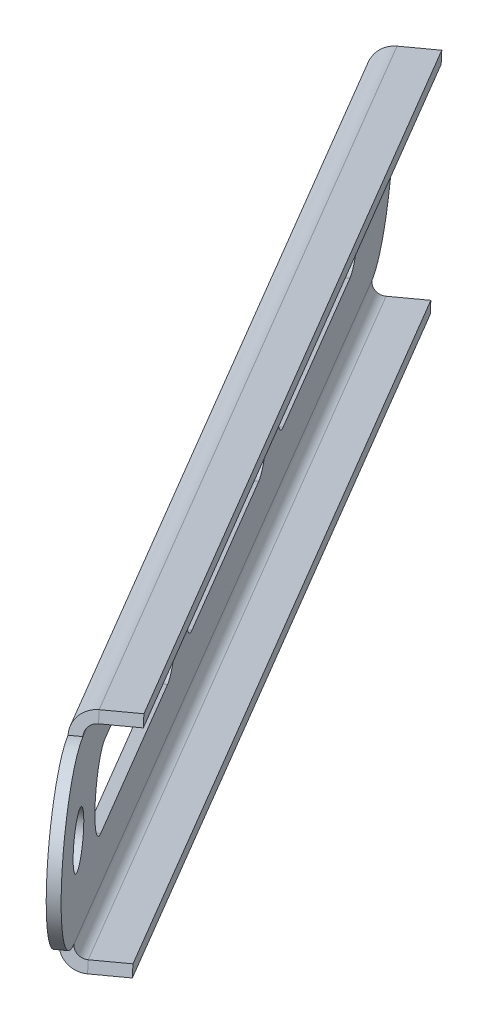
ISO-10303-21;
HEADER;
FILE_DESCRIPTION(('STEP AP214'),'2;1');
FILE_NAME('part.step','',(''),(''),'','','');
FILE_SCHEMA(('AUTOMOTIVE_DESIGN { 1 0 10303 214 1 1 1 1 }'));
ENDSEC;
DATA;
#1=APPLICATION_CONTEXT('core data for automotive mechanical design processes');
#2=APPLICATION_PROTOCOL_DEFINITION('international standard','automotive_design',2000,#1);
#3=PRODUCT_CONTEXT('',#1,'mechanical');
#4=PRODUCT('Part','Part','',(#3));
#5=PRODUCT_RELATED_PRODUCT_CATEGORY('part','',(#4));
#6=PRODUCT_DEFINITION_FORMATION('','',#4);
#7=PRODUCT_DEFINITION_CONTEXT('part definition',#1,'design');
#8=PRODUCT_DEFINITION('design','',#6,#7);
#9=PRODUCT_DEFINITION_SHAPE('','',#8);
#10=(LENGTH_UNIT() NAMED_UNIT(*) SI_UNIT(.MILLI.,.METRE.));
#11=(NAMED_UNIT(*) PLANE_ANGLE_UNIT() SI_UNIT($,.RADIAN.));
#12=(NAMED_UNIT(*) SI_UNIT($,.STERADIAN.) SOLID_ANGLE_UNIT());
#13=UNCERTAINTY_MEASURE_WITH_UNIT(LENGTH_MEASURE(1.E-05),#10,'distance_accuracy_value','');
#14=(GEOMETRIC_REPRESENTATION_CONTEXT(3) GLOBAL_UNCERTAINTY_ASSIGNED_CONTEXT((#13)) GLOBAL_UNIT_ASSIGNED_CONTEXT((#10,
#11,#12)) REPRESENTATION_CONTEXT('',''));
#15=CARTESIAN_POINT('',(0.,0.,0.));
#16=DIRECTION('',(0.,0.,1.));
#17=DIRECTION('',(1.,0.,0.));
#18=AXIS2_PLACEMENT_3D('',#15,#16,#17);
#19=CARTESIAN_POINT('',(45.9160006224801,2.19416637471988,-185.431775274375));
#20=DIRECTION('',(0.809016994374949,0.,-0.587785252292471));
#21=DIRECTION('',(-0.587785252292471,0.,-0.809016994374949));
#22=AXIS2_PLACEMENT_3D('',#19,#20,#21);
#23=CYLINDRICAL_SURFACE('',#22,5.);
#24=DIRECTION('',(0.809016994374949,0.,-0.587785252292471));
#25=VECTOR('',#24,1.);
#26=CARTESIAN_POINT('',(45.1456040160047,7.01932189784863,-186.49213523512));
#27=LINE('',#26,#25);
#28=CARTESIAN_POINT('',(43.9320785244423,7.01932189784863,-185.610457356681));
#29=VERTEX_POINT('',#28);
#30=CARTESIAN_POINT('',(45.1456040160047,7.01932189784863,-186.49213523512));
#31=VERTEX_POINT('',#30);
#32=EDGE_CURVE('E11',#29,#31,#27,.T.);
#33=ORIENTED_EDGE('',*,*,#32,.F.);
#34=CARTESIAN_POINT('',(44.7024751309177,2.19416637471988,-184.550097395936));
#35=DIRECTION('',(0.809016994374949,0.,-0.587785252292471));
#36=DIRECTION('',(-0.587785252292471,0.,-0.809016994374949));
#37=AXIS2_PLACEMENT_3D('',#34,#35,#36);
#38=CIRCLE('',#37,5.);
#39=CARTESIAN_POINT('',(45.4728717373931,-2.63098914840886,-183.489737435191));
#40=VERTEX_POINT('',#39);
#41=EDGE_CURVE('E122',#40,#29,#38,.T.);
#42=ORIENTED_EDGE('',*,*,#41,.F.);
#43=DIRECTION('',(0.809016994374949,0.,-0.587785252292471));
#44=VECTOR('',#43,1.);
#45=CARTESIAN_POINT('',(46.6863972289555,-2.63098914840886,-184.371415313629));
#46=LINE('',#45,#44);
#47=CARTESIAN_POINT('',(46.6863972289555,-2.63098914840886,-184.371415313629));
#48=VERTEX_POINT('',#47);
#49=EDGE_CURVE('E46',#40,#48,#46,.T.);
#50=ORIENTED_EDGE('',*,*,#49,.T.);
#51=CARTESIAN_POINT('',(45.9160006224801,2.19416637471988,-185.431775274375));
#52=DIRECTION('',(0.809016994374949,0.,-0.587785252292471));
#53=DIRECTION('',(-0.587785252292471,0.,-0.809016994374949));
#54=AXIS2_PLACEMENT_3D('',#51,#52,#53);
#55=CIRCLE('',#54,5.);
#56=EDGE_CURVE('E176',#48,#31,#55,.T.);
#57=ORIENTED_EDGE('',*,*,#56,.T.);
#58=EDGE_LOOP('',(#33,#42,#50,#57));
#59=FACE_BOUND('',#58,.T.);
#60=ADVANCED_FACE('F36',(#59),#23,.F.);
#61=CARTESIAN_POINT('',(71.6443196233266,8.90285568529785,-150.019782157494));
#62=DIRECTION('',(-0.154079321295082,0.965031104625748,-0.212071992149022));
#63=DIRECTION('',(-0.567231051302528,-0.262135398419992,-0.78072656374266));
#64=AXIS2_PLACEMENT_3D('',#61,#62,#63);
#65=PLANE('',#64);
#66=ORIENTED_EDGE('',*,*,#49,.F.);
#67=DIRECTION('',(-0.567231051302528,-0.262135398419992,-0.78072656374266));
#68=VECTOR('',#67,1.);
#69=CARTESIAN_POINT('',(70.4307941317641,8.90285568529785,-149.138104279056));
#70=LINE('',#69,#68);
#71=CARTESIAN_POINT('',(70.4307941317641,8.90285568529785,-149.138104279056));
#72=VERTEX_POINT('',#71);
#73=EDGE_CURVE('E134',#72,#40,#70,.T.);
#74=ORIENTED_EDGE('',*,*,#73,.F.);
#75=DIRECTION('',(0.809016994374949,0.,-0.587785252292471));
#76=VECTOR('',#75,1.);
#77=CARTESIAN_POINT('',(71.6443196233266,8.90285568529785,-150.019782157494));
#78=LINE('',#77,#76);
#79=CARTESIAN_POINT('',(71.6443196233266,8.90285568529785,-150.019782157494));
#80=VERTEX_POINT('',#79);
#81=EDGE_CURVE('E54',#72,#80,#78,.T.);
#82=ORIENTED_EDGE('',*,*,#81,.T.);
#83=DIRECTION('',(-0.567231051302528,-0.262135398419992,-0.78072656374266));
#84=VECTOR('',#83,1.);
#85=CARTESIAN_POINT('',(71.6443196233266,8.90285568529785,-150.019782157494));
#86=LINE('',#85,#84);
#87=EDGE_CURVE('E151',#80,#48,#86,.T.);
#88=ORIENTED_EDGE('',*,*,#87,.T.);
#89=EDGE_LOOP('',(#66,#74,#82,#88));
#90=FACE_BOUND('',#89,.T.);
#91=ADVANCED_FACE('F181',(#90),#65,.T.);
#92=CARTESIAN_POINT('',(70.8739230168511,13.7280112084266,-151.08014211824));
#93=DIRECTION('',(0.809016994374949,0.,-0.587785252292471));
#94=DIRECTION('',(-0.587785252292471,0.,-0.809016994374949));
#95=AXIS2_PLACEMENT_3D('',#92,#93,#94);
#96=CYLINDRICAL_SURFACE('',#95,5.);
#97=ORIENTED_EDGE('',*,*,#81,.F.);
#98=CARTESIAN_POINT('',(69.6603975252887,13.7280112084266,-150.198464239801));
#99=DIRECTION('',(0.809016994374949,0.,-0.587785252292471));
#100=DIRECTION('',(-0.587785252292471,0.,-0.809016994374949));
#101=AXIS2_PLACEMENT_3D('',#98,#99,#100);
#102=CIRCLE('',#101,5.);
#103=CARTESIAN_POINT('',(68.8900009188133,18.5531667315553,-151.258824200546));
#104=VERTEX_POINT('',#103);
#105=EDGE_CURVE('E121',#104,#72,#102,.T.);
#106=ORIENTED_EDGE('',*,*,#105,.F.);
#107=DIRECTION('',(0.809016994374949,0.,-0.587785252292471));
#108=VECTOR('',#107,1.);
#109=CARTESIAN_POINT('',(70.1035264103757,18.5531667315553,-152.140502078985));
#110=LINE('',#109,#108);
#111=CARTESIAN_POINT('',(70.1035264103757,18.5531667315553,-152.140502078985));
#112=VERTEX_POINT('',#111);
#113=EDGE_CURVE('E40',#104,#112,#110,.T.);
#114=ORIENTED_EDGE('',*,*,#113,.T.);
#115=CARTESIAN_POINT('',(70.8739230168511,13.7280112084266,-151.08014211824));
#116=DIRECTION('',(0.809016994374949,0.,-0.587785252292471));
#117=DIRECTION('',(-0.587785252292471,0.,-0.809016994374949));
#118=AXIS2_PLACEMENT_3D('',#115,#116,#117);
#119=CIRCLE('',#118,5.);
#120=EDGE_CURVE('E447',#112,#80,#119,.T.);
#121=ORIENTED_EDGE('',*,*,#120,.T.);
#122=EDGE_LOOP('',(#97,#106,#114,#121));
#123=FACE_BOUND('',#122,.T.);
#124=ADVANCED_FACE('F124',(#123),#96,.F.);
#125=CARTESIAN_POINT('',(113.983239052903,33.650188791573,-91.7452589223394));
#126=DIRECTION('',(0.809016994374949,0.,-0.587785252292471));
#127=DIRECTION('',(-0.587785252292471,0.,-0.809016994374949));
#128=AXIS2_PLACEMENT_3D('',#125,#126,#127);
#129=CYLINDRICAL_SURFACE('',#128,5.00000000000001);
#130=DIRECTION('',(0.809016994374949,0.,-0.587785252292471));
#131=VECTOR('',#130,1.);
#132=CARTESIAN_POINT('',(113.212842446428,38.4753443147018,-92.8056188830845));
#133=LINE('',#132,#131);
#134=CARTESIAN_POINT('',(111.999316954865,38.4753443147018,-91.9239410046458));
#135=VERTEX_POINT('',#134);
#136=CARTESIAN_POINT('',(113.212842446428,38.4753443147018,-92.8056188830845));
#137=VERTEX_POINT('',#136);
#138=EDGE_CURVE('E116',#135,#137,#133,.T.);
#139=ORIENTED_EDGE('',*,*,#138,.F.);
#140=CARTESIAN_POINT('',(112.769713561341,33.650188791573,-90.8635810439007));
#141=DIRECTION('',(0.809016994374949,0.,-0.587785252292471));
#142=DIRECTION('',(-0.587785252292471,0.,-0.809016994374949));
#143=AXIS2_PLACEMENT_3D('',#140,#141,#142);
#144=CIRCLE('',#143,5.00000000000001);
#145=CARTESIAN_POINT('',(113.540110167816,28.8250332684443,-89.8032210831556));
#146=VERTEX_POINT('',#145);
#147=EDGE_CURVE('E128',#146,#135,#144,.T.);
#148=ORIENTED_EDGE('',*,*,#147,.F.);
#149=DIRECTION('',(0.809016994374949,0.,-0.587785252292471));
#150=VECTOR('',#149,1.);
#151=CARTESIAN_POINT('',(114.753635659378,28.8250332684443,-90.6848989615943));
#152=LINE('',#151,#150);
#153=CARTESIAN_POINT('',(114.753635659378,28.8250332684443,-90.6848989615943));
#154=VERTEX_POINT('',#153);
#155=EDGE_CURVE('E167',#146,#154,#152,.T.);
#156=ORIENTED_EDGE('',*,*,#155,.T.);
#157=CARTESIAN_POINT('',(113.983239052903,33.650188791573,-91.7452589223394));
#158=DIRECTION('',(0.809016994374949,0.,-0.587785252292471));
#159=DIRECTION('',(-0.587785252292471,0.,-0.809016994374949));
#160=AXIS2_PLACEMENT_3D('',#157,#158,#159);
#161=CIRCLE('',#160,5.00000000000001);
#162=EDGE_CURVE('E443',#154,#137,#161,.T.);
#163=ORIENTED_EDGE('',*,*,#162,.T.);
#164=EDGE_LOOP('',(#139,#148,#156,#163));
#165=FACE_BOUND('',#164,.T.);
#166=ADVANCED_FACE('F450',(#165),#129,.F.);
#167=CARTESIAN_POINT('',(139.711558053749,40.358878102151,-56.3332658054592));
#168=DIRECTION('',(-0.154079321295082,0.965031104625748,-0.212071992149022));
#169=DIRECTION('',(-0.567231051302528,-0.262135398419992,-0.78072656374266));
#170=AXIS2_PLACEMENT_3D('',#167,#168,#169);
#171=PLANE('',#170);
#172=ORIENTED_EDGE('',*,*,#155,.F.);
#173=DIRECTION('',(-0.567231051302528,-0.262135398419992,-0.78072656374266));
#174=VECTOR('',#173,1.);
#175=CARTESIAN_POINT('',(138.498032562187,40.358878102151,-55.4515879270205));
#176=LINE('',#175,#174);
#177=CARTESIAN_POINT('',(138.498032562187,40.358878102151,-55.4515879270205));
#178=VERTEX_POINT('',#177);
#179=EDGE_CURVE('E125',#178,#146,#176,.T.);
#180=ORIENTED_EDGE('',*,*,#179,.F.);
#181=DIRECTION('',(0.809016994374949,0.,-0.587785252292471));
#182=VECTOR('',#181,1.);
#183=CARTESIAN_POINT('',(139.711558053749,40.358878102151,-56.3332658054592));
#184=LINE('',#183,#182);
#185=CARTESIAN_POINT('',(139.711558053749,40.358878102151,-56.3332658054592));
#186=VERTEX_POINT('',#185);
#187=EDGE_CURVE('E164',#178,#186,#184,.T.);
#188=ORIENTED_EDGE('',*,*,#187,.T.);
#189=DIRECTION('',(-0.567231051302528,-0.262135398419992,-0.78072656374266));
#190=VECTOR('',#189,1.);
#191=CARTESIAN_POINT('',(139.711558053749,40.358878102151,-56.3332658054592));
#192=LINE('',#191,#190);
#193=EDGE_CURVE('E237',#186,#154,#192,.T.);
#194=ORIENTED_EDGE('',*,*,#193,.T.);
#195=EDGE_LOOP('',(#172,#180,#188,#194));
#196=FACE_BOUND('',#195,.T.);
#197=ADVANCED_FACE('F235',(#196),#171,.T.);
#198=CARTESIAN_POINT('',(138.941161447274,45.1840336252797,-57.3936257662043));
#199=DIRECTION('',(0.809016994374949,0.,-0.587785252292471));
#200=DIRECTION('',(-0.587785252292471,0.,-0.809016994374949));
#201=AXIS2_PLACEMENT_3D('',#198,#199,#200);
#202=CYLINDRICAL_SURFACE('',#201,5.00000000000001);
#203=ORIENTED_EDGE('',*,*,#187,.F.);
#204=CARTESIAN_POINT('',(137.727635955712,45.1840336252797,-56.5119478877656));
#205=DIRECTION('',(0.809016994374949,0.,-0.587785252292471));
#206=DIRECTION('',(-0.587785252292471,0.,-0.809016994374949));
#207=AXIS2_PLACEMENT_3D('',#204,#205,#206);
#208=CIRCLE('',#207,5.00000000000001);
#209=CARTESIAN_POINT('',(136.957239349236,50.0091891484085,-57.5723078485107));
#210=VERTEX_POINT('',#209);
#211=EDGE_CURVE('E215',#210,#178,#208,.T.);
#212=ORIENTED_EDGE('',*,*,#211,.F.);
#213=DIRECTION('',(0.809016994374949,0.,-0.587785252292471));
#214=VECTOR('',#213,1.);
#215=CARTESIAN_POINT('',(138.170764840799,50.0091891484085,-58.4539857269494));
#216=LINE('',#215,#214);
#217=CARTESIAN_POINT('',(138.170764840799,50.0091891484085,-58.4539857269494));
#218=VERTEX_POINT('',#217);
#219=EDGE_CURVE('E161',#210,#218,#216,.T.);
#220=ORIENTED_EDGE('',*,*,#219,.T.);
#221=CARTESIAN_POINT('',(138.941161447274,45.1840336252797,-57.3936257662043));
#222=DIRECTION('',(0.809016994374949,0.,-0.587785252292471));
#223=DIRECTION('',(-0.587785252292471,0.,-0.809016994374949));
#224=AXIS2_PLACEMENT_3D('',#221,#222,#223);
#225=CIRCLE('',#224,5.00000000000001);
#226=EDGE_CURVE('E231',#218,#186,#225,.T.);
#227=ORIENTED_EDGE('',*,*,#226,.T.);
#228=EDGE_LOOP('',(#203,#212,#220,#227));
#229=FACE_BOUND('',#228,.T.);
#230=ADVANCED_FACE('F226',(#229),#202,.F.);
#231=CARTESIAN_POINT('',(148.016858268115,49.3781999999996,-44.9020007463218));
#232=DIRECTION('',(0.809016994374949,0.,-0.587785252292471));
#233=DIRECTION('',(-0.587785252292471,0.,-0.809016994374949));
#234=AXIS2_PLACEMENT_3D('',#231,#232,#233);
#235=CYLINDRICAL_SURFACE('',#234,11.);
#236=DIRECTION('',(0.809016994374949,0.,-0.587785252292471));
#237=VECTOR('',#236,1.);
#238=CARTESIAN_POINT('',(146.321985733869,59.9935421508828,-47.234792659961));
#239=LINE('',#238,#237);
#240=CARTESIAN_POINT('',(145.108460242306,59.9935421508828,-46.3531147815223));
#241=VERTEX_POINT('',#240);
#242=CARTESIAN_POINT('',(146.321985733869,59.9935421508828,-47.234792659961));
#243=VERTEX_POINT('',#242);
#244=EDGE_CURVE('E158',#241,#243,#239,.T.);
#245=ORIENTED_EDGE('',*,*,#244,.F.);
#246=CARTESIAN_POINT('',(146.803332776552,49.3781999999996,-44.0203228678831));
#247=DIRECTION('',(0.809016994374949,0.,-0.587785252292471));
#248=DIRECTION('',(-0.587785252292471,0.,-0.809016994374949));
#249=AXIS2_PLACEMENT_3D('',#246,#247,#248);
#250=CIRCLE('',#249,11.);
#251=CARTESIAN_POINT('',(148.498205310798,38.7628578491164,-41.6875309542438));
#252=VERTEX_POINT('',#251);
#253=EDGE_CURVE('E209',#241,#252,#250,.T.);
#254=ORIENTED_EDGE('',*,*,#253,.T.);
#255=DIRECTION('',(0.809016994374949,0.,-0.587785252292471));
#256=VECTOR('',#255,1.);
#257=CARTESIAN_POINT('',(149.71173080236,38.7628578491164,-42.5692088326825));
#258=LINE('',#257,#256);
#259=CARTESIAN_POINT('',(149.71173080236,38.7628578491164,-42.5692088326825));
#260=VERTEX_POINT('',#259);
#261=EDGE_CURVE('E155',#252,#260,#258,.T.);
#262=ORIENTED_EDGE('',*,*,#261,.T.);
#263=CARTESIAN_POINT('',(148.016858268115,49.3781999999996,-44.9020007463218));
#264=DIRECTION('',(0.809016994374949,0.,-0.587785252292471));
#265=DIRECTION('',(-0.587785252292471,0.,-0.809016994374949));
#266=AXIS2_PLACEMENT_3D('',#263,#264,#265);
#267=CIRCLE('',#266,11.);
#268=EDGE_CURVE('E430',#243,#260,#267,.T.);
#269=ORIENTED_EDGE('',*,*,#268,.F.);
#270=EDGE_LOOP('',(#245,#254,#262,#269));
#271=FACE_BOUND('',#270,.T.);
#272=ADVANCED_FACE('F481',(#271),#235,.T.);
#273=CARTESIAN_POINT('',(36.8403038016397,-2.,-197.923400294257));
#274=DIRECTION('',(0.809016994374949,0.,-0.587785252292471));
#275=DIRECTION('',(-0.587785252292471,0.,-0.809016994374949));
#276=AXIS2_PLACEMENT_3D('',#273,#274,#275);
#277=CYLINDRICAL_SURFACE('',#276,11.);
#278=DIRECTION('',(0.809016994374949,0.,-0.587785252292471));
#279=VECTOR('',#278,1.);
#280=CARTESIAN_POINT('',(38.5351763358856,-12.6153421508832,-195.590608380618));
#281=LINE('',#280,#279);
#282=CARTESIAN_POINT('',(37.3216508443235,-12.6153421508833,-194.708930502179));
#283=VERTEX_POINT('',#282);
#284=CARTESIAN_POINT('',(38.5351763358856,-12.6153421508832,-195.590608380618));
#285=VERTEX_POINT('',#284);
#286=EDGE_CURVE('E152',#283,#285,#281,.T.);
#287=ORIENTED_EDGE('',*,*,#286,.F.);
#288=CARTESIAN_POINT('',(35.6267783100773,-2.,-197.041722415818));
#289=DIRECTION('',(0.809016994374949,0.,-0.587785252292471));
#290=DIRECTION('',(-0.587785252292471,0.,-0.809016994374949));
#291=AXIS2_PLACEMENT_3D('',#288,#289,#290);
#292=CIRCLE('',#291,11.);
#293=CARTESIAN_POINT('',(33.9319057758313,8.61534215088324,-199.374514329458));
#294=VERTEX_POINT('',#293);
#295=EDGE_CURVE('E201',#283,#294,#292,.T.);
#296=ORIENTED_EDGE('',*,*,#295,.T.);
#297=DIRECTION('',(0.809016994374949,0.,-0.587785252292471));
#298=VECTOR('',#297,1.);
#299=CARTESIAN_POINT('',(35.1454312673938,8.61534215088323,-200.256192207896));
#300=LINE('',#299,#298);
#301=CARTESIAN_POINT('',(35.1454312673938,8.61534215088323,-200.256192207896));
#302=VERTEX_POINT('',#301);
#303=EDGE_CURVE('E148',#294,#302,#300,.T.);
#304=ORIENTED_EDGE('',*,*,#303,.T.);
#305=CARTESIAN_POINT('',(36.8403038016397,-2.,-197.923400294257));
#306=DIRECTION('',(0.809016994374949,0.,-0.587785252292471));
#307=DIRECTION('',(0.587785252292471,0.,0.809016994374949));
#308=AXIS2_PLACEMENT_3D('',#305,#306,#307);
#309=CIRCLE('',#308,11.);
#310=EDGE_CURVE('E425',#285,#302,#309,.T.);
#311=ORIENTED_EDGE('',*,*,#310,.F.);
#312=EDGE_LOOP('',(#287,#296,#304,#311));
#313=FACE_BOUND('',#312,.T.);
#314=ADVANCED_FACE('F485',(#313),#277,.T.);
#315=CARTESIAN_POINT('',(79.9496198376916,17.9221775831464,-138.588517098357));
#316=DIRECTION('',(0.809016994374949,0.,-0.587785252292471));
#317=DIRECTION('',(-0.587785252292471,0.,-0.809016994374949));
#318=AXIS2_PLACEMENT_3D('',#315,#316,#317);
#319=CYLINDRICAL_SURFACE('',#318,5.00000000000002);
#320=DIRECTION('',(0.809016994374949,0.,-0.587785252292471));
#321=VECTOR('',#320,1.);
#322=CARTESIAN_POINT('',(79.1792232312162,22.7473331062752,-139.648877059102));
#323=LINE('',#322,#321);
#324=CARTESIAN_POINT('',(77.9656977396537,22.7473331062752,-138.767199180663));
#325=VERTEX_POINT('',#324);
#326=CARTESIAN_POINT('',(79.1792232312162,22.7473331062752,-139.648877059102));
#327=VERTEX_POINT('',#326);
#328=EDGE_CURVE('E145',#325,#327,#323,.T.);
#329=ORIENTED_EDGE('',*,*,#328,.F.);
#330=CARTESIAN_POINT('',(78.7360943461292,17.9221775831464,-137.706839219918));
#331=DIRECTION('',(0.809016994374949,0.,-0.587785252292471));
#332=DIRECTION('',(-0.587785252292471,0.,-0.809016994374949));
#333=AXIS2_PLACEMENT_3D('',#330,#331,#332);
#334=CIRCLE('',#333,5.00000000000002);
#335=CARTESIAN_POINT('',(79.5064909526046,13.0970220600177,-136.646479259173));
#336=VERTEX_POINT('',#335);
#337=EDGE_CURVE('E194',#336,#325,#334,.T.);
#338=ORIENTED_EDGE('',*,*,#337,.F.);
#339=DIRECTION('',(0.809016994374949,0.,-0.587785252292471));
#340=VECTOR('',#339,1.);
#341=CARTESIAN_POINT('',(80.720016444167,13.0970220600177,-137.528157137612));
#342=LINE('',#341,#340);
#343=CARTESIAN_POINT('',(80.720016444167,13.0970220600177,-137.528157137612));
#344=VERTEX_POINT('',#343);
#345=EDGE_CURVE('E141',#336,#344,#342,.T.);
#346=ORIENTED_EDGE('',*,*,#345,.T.);
#347=CARTESIAN_POINT('',(79.9496198376916,17.9221775831464,-138.588517098357));
#348=DIRECTION('',(0.809016994374949,0.,-0.587785252292471));
#349=DIRECTION('',(-0.587785252292471,0.,-0.809016994374949));
#350=AXIS2_PLACEMENT_3D('',#347,#348,#349);
#351=CIRCLE('',#350,5.00000000000002);
#352=EDGE_CURVE('E416',#344,#327,#351,.T.);
#353=ORIENTED_EDGE('',*,*,#352,.T.);
#354=EDGE_LOOP('',(#329,#338,#346,#353));
#355=FACE_BOUND('',#354,.T.);
#356=ADVANCED_FACE('F489',(#355),#319,.F.);
#357=CARTESIAN_POINT('',(105.677938838538,24.6308668937244,-103.176523981477));
#358=DIRECTION('',(-0.154079321295082,0.965031104625748,-0.212071992149022));
#359=DIRECTION('',(-0.567231051302528,-0.262135398419992,-0.780726563742659));
#360=AXIS2_PLACEMENT_3D('',#357,#358,#359);
#361=PLANE('',#360);
#362=ORIENTED_EDGE('',*,*,#345,.F.);
#363=DIRECTION('',(-0.567231051302528,-0.262135398419992,-0.780726563742659));
#364=VECTOR('',#363,1.);
#365=CARTESIAN_POINT('',(104.464413346976,24.6308668937244,-102.294846103038));
#366=LINE('',#365,#364);
#367=CARTESIAN_POINT('',(104.464413346976,24.6308668937244,-102.294846103038));
#368=VERTEX_POINT('',#367);
#369=EDGE_CURVE('E190',#368,#336,#366,.T.);
#370=ORIENTED_EDGE('',*,*,#369,.F.);
#371=DIRECTION('',(0.809016994374949,0.,-0.587785252292471));
#372=VECTOR('',#371,1.);
#373=CARTESIAN_POINT('',(105.677938838538,24.6308668937244,-103.176523981477));
#374=LINE('',#373,#372);
#375=CARTESIAN_POINT('',(105.677938838538,24.6308668937244,-103.176523981477));
#376=VERTEX_POINT('',#375);
#377=EDGE_CURVE('E138',#368,#376,#374,.T.);
#378=ORIENTED_EDGE('',*,*,#377,.T.);
#379=DIRECTION('',(-0.567231051302528,-0.262135398419992,-0.780726563742659));
#380=VECTOR('',#379,1.);
#381=CARTESIAN_POINT('',(105.677938838538,24.6308668937244,-103.176523981477));
#382=LINE('',#381,#380);
#383=EDGE_CURVE('E419',#376,#344,#382,.T.);
#384=ORIENTED_EDGE('',*,*,#383,.T.);
#385=EDGE_LOOP('',(#362,#370,#378,#384));
#386=FACE_BOUND('',#385,.T.);
#387=ADVANCED_FACE('F501',(#386),#361,.T.);
#388=CARTESIAN_POINT('',(104.907542232063,29.4560224168532,-104.236883942222));
#389=DIRECTION('',(0.809016994374949,0.,-0.587785252292471));
#390=DIRECTION('',(-0.587785252292471,0.,-0.809016994374949));
#391=AXIS2_PLACEMENT_3D('',#388,#389,#390);
#392=CYLINDRICAL_SURFACE('',#391,5.00000000000001);
#393=ORIENTED_EDGE('',*,*,#377,.F.);
#394=CARTESIAN_POINT('',(103.6940167405,29.4560224168532,-103.355206063783));
#395=DIRECTION('',(0.809016994374949,0.,-0.587785252292471));
#396=DIRECTION('',(-0.587785252292471,0.,-0.809016994374949));
#397=AXIS2_PLACEMENT_3D('',#394,#395,#396);
#398=CIRCLE('',#397,5.00000000000001);
#399=CARTESIAN_POINT('',(102.923620134025,34.2811779399819,-104.415566024528));
#400=VERTEX_POINT('',#399);
#401=EDGE_CURVE('E185',#400,#368,#398,.T.);
#402=ORIENTED_EDGE('',*,*,#401,.F.);
#403=DIRECTION('',(0.809016994374949,0.,-0.587785252292471));
#404=VECTOR('',#403,1.);
#405=CARTESIAN_POINT('',(104.137145625587,34.2811779399819,-105.297243902967));
#406=LINE('',#405,#404);
#407=CARTESIAN_POINT('',(104.137145625587,34.2811779399819,-105.297243902967));
#408=VERTEX_POINT('',#407);
#409=EDGE_CURVE('E142',#400,#408,#406,.T.);
#410=ORIENTED_EDGE('',*,*,#409,.T.);
#411=CARTESIAN_POINT('',(104.907542232063,29.4560224168532,-104.236883942222));
#412=DIRECTION('',(0.809016994374949,0.,-0.587785252292471));
#413=DIRECTION('',(-0.587785252292471,0.,-0.809016994374949));
#414=AXIS2_PLACEMENT_3D('',#411,#412,#413);
#415=CIRCLE('',#414,5.00000000000001);
#416=EDGE_CURVE('E136',#408,#376,#415,.T.);
#417=ORIENTED_EDGE('',*,*,#416,.T.);
#418=EDGE_LOOP('',(#393,#402,#410,#417));
#419=FACE_BOUND('',#418,.T.);
#420=ADVANCED_FACE('F497',(#419),#392,.F.);
#421=CARTESIAN_POINT('',(104.137145625587,34.2811779399819,-105.297243902967));
#422=DIRECTION('',(0.154079321295082,-0.965031104625748,0.212071992149021));
#423=DIRECTION('',(0.567231051302528,0.262135398419992,0.78072656374266));
#424=AXIS2_PLACEMENT_3D('',#421,#422,#423);
#425=PLANE('',#424);
#426=DIRECTION('',(0.567231051302528,0.262135398419992,0.78072656374266));
#427=VECTOR('',#426,1.);
#428=CARTESIAN_POINT('',(102.923620134025,34.2811779399819,-104.415566024528));
#429=LINE('',#428,#427);
#430=EDGE_CURVE('E188',#325,#400,#429,.T.);
#431=ORIENTED_EDGE('',*,*,#430,.F.);
#432=ORIENTED_EDGE('',*,*,#328,.T.);
#433=DIRECTION('',(0.567231051302528,0.262135398419992,0.78072656374266));
#434=VECTOR('',#433,1.);
#435=CARTESIAN_POINT('',(104.137145625587,34.2811779399819,-105.297243902967));
#436=LINE('',#435,#434);
#437=EDGE_CURVE('E413',#327,#408,#436,.T.);
#438=ORIENTED_EDGE('',*,*,#437,.T.);
#439=ORIENTED_EDGE('',*,*,#409,.F.);
#440=EDGE_LOOP('',(#431,#432,#438,#439));
#441=FACE_BOUND('',#440,.T.);
#442=ADVANCED_FACE('F493',(#441),#425,.T.);
#443=CARTESIAN_POINT('',(148.016858268115,49.3781999999996,-44.9020007463218));
#444=DIRECTION('',(0.809016994374949,0.,-0.587785252292471));
#445=DIRECTION('',(-0.587785252292471,0.,-0.809016994374949));
#446=AXIS2_PLACEMENT_3D('',#443,#444,#445);
#447=CYLINDRICAL_SURFACE('',#446,3.3782);
#448=CARTESIAN_POINT('',(148.016858268115,49.3781999999996,-44.9020007463218));
#449=DIRECTION('',(0.809016994374949,0.,-0.587785252292471));
#450=DIRECTION('',(-0.587785252292471,0.,-0.809016994374949));
#451=AXIS2_PLACEMENT_3D('',#448,#449,#450);
#452=CIRCLE('',#451,3.3782);
#453=CARTESIAN_POINT('',(146.03120212882,49.3781999999996,-47.6350219567192));
#454=VERTEX_POINT('',#453);
#455=EDGE_CURVE('E422',#454,#454,#452,.T.);
#456=ORIENTED_EDGE('',*,*,#455,.T.);
#457=EDGE_LOOP('',(#456));
#458=FACE_BOUND('',#457,.T.);
#459=CARTESIAN_POINT('',(146.803332776552,49.3781999999996,-44.0203228678831));
#460=DIRECTION('',(0.809016994374949,0.,-0.587785252292471));
#461=DIRECTION('',(-0.587785252292471,0.,-0.809016994374949));
#462=AXIS2_PLACEMENT_3D('',#459,#460,#461);
#463=CIRCLE('',#462,3.3782);
#464=CARTESIAN_POINT('',(144.817676637258,49.3781999999996,-46.7533440782805));
#465=VERTEX_POINT('',#464);
#466=EDGE_CURVE('E193',#465,#465,#463,.T.);
#467=ORIENTED_EDGE('',*,*,#466,.F.);
#468=EDGE_LOOP('',(#467));
#469=FACE_BOUND('',#468,.T.);
#470=ADVANCED_FACE('F461',(#458,#469),#447,.F.);
#471=CARTESIAN_POINT('',(36.8403038016397,-2.,-197.923400294257));
#472=DIRECTION('',(0.809016994374949,0.,-0.587785252292471));
#473=DIRECTION('',(-0.587785252292471,0.,-0.809016994374949));
#474=AXIS2_PLACEMENT_3D('',#471,#472,#473);
#475=CYLINDRICAL_SURFACE('',#474,3.37819999999995);
#476=CARTESIAN_POINT('',(36.8403038016397,-2.,-197.923400294257));
#477=DIRECTION('',(0.809016994374949,0.,-0.587785252292471));
#478=DIRECTION('',(-0.587785252292471,0.,-0.809016994374949));
#479=AXIS2_PLACEMENT_3D('',#476,#477,#478);
#480=CIRCLE('',#479,3.37819999999995);
#481=CARTESIAN_POINT('',(34.8546476623453,-2.,-200.656421504655));
#482=VERTEX_POINT('',#481);
#483=EDGE_CURVE('E436',#482,#482,#480,.T.);
#484=ORIENTED_EDGE('',*,*,#483,.T.);
#485=EDGE_LOOP('',(#484));
#486=FACE_BOUND('',#485,.T.);
#487=CARTESIAN_POINT('',(35.6267783100773,-2.,-197.041722415818));
#488=DIRECTION('',(0.809016994374949,0.,-0.587785252292471));
#489=DIRECTION('',(-0.587785252292471,0.,-0.809016994374949));
#490=AXIS2_PLACEMENT_3D('',#487,#488,#489);
#491=CIRCLE('',#490,3.37819999999995);
#492=CARTESIAN_POINT('',(33.6411221707829,-2.,-199.774743626216));
#493=VERTEX_POINT('',#492);
#494=EDGE_CURVE('E208',#493,#493,#491,.T.);
#495=ORIENTED_EDGE('',*,*,#494,.F.);
#496=EDGE_LOOP('',(#495));
#497=FACE_BOUND('',#496,.T.);
#498=ADVANCED_FACE('F455',(#486,#497),#475,.F.);
#499=CARTESIAN_POINT('',(138.170764840799,50.0091891484085,-58.4539857269494));
#500=DIRECTION('',(0.154079321295082,-0.965031104625748,0.212071992149022));
#501=DIRECTION('',(0.567231051302528,0.262135398419992,0.780726563742659));
#502=AXIS2_PLACEMENT_3D('',#499,#500,#501);
#503=PLANE('',#502);
#504=DIRECTION('',(0.567231051302528,0.262135398419992,0.780726563742659));
#505=VECTOR('',#504,1.);
#506=CARTESIAN_POINT('',(136.957239349236,50.0091891484085,-57.5723078485107));
#507=LINE('',#506,#505);
#508=EDGE_CURVE('E132',#135,#210,#507,.T.);
#509=ORIENTED_EDGE('',*,*,#508,.F.);
#510=ORIENTED_EDGE('',*,*,#138,.T.);
#511=DIRECTION('',(0.567231051302528,0.262135398419992,0.780726563742659));
#512=VECTOR('',#511,1.);
#513=CARTESIAN_POINT('',(138.170764840799,50.0091891484085,-58.4539857269494));
#514=LINE('',#513,#512);
#515=EDGE_CURVE('E440',#137,#218,#514,.T.);
#516=ORIENTED_EDGE('',*,*,#515,.T.);
#517=ORIENTED_EDGE('',*,*,#219,.F.);
#518=EDGE_LOOP('',(#509,#510,#516,#517));
#519=FACE_BOUND('',#518,.T.);
#520=ADVANCED_FACE('F453',(#519),#503,.T.);
#521=CARTESIAN_POINT('',(70.1035264103757,18.5531667315553,-152.140502078985));
#522=DIRECTION('',(0.154079321295082,-0.965031104625748,0.212071992149021));
#523=DIRECTION('',(0.567231051302528,0.262135398419992,0.78072656374266));
#524=AXIS2_PLACEMENT_3D('',#521,#522,#523);
#525=PLANE('',#524);
#526=DIRECTION('',(0.567231051302528,0.262135398419992,0.78072656374266));
#527=VECTOR('',#526,1.);
#528=CARTESIAN_POINT('',(68.8900009188133,18.5531667315553,-151.258824200546));
#529=LINE('',#528,#527);
#530=EDGE_CURVE('E109',#29,#104,#529,.T.);
#531=ORIENTED_EDGE('',*,*,#530,.F.);
#532=ORIENTED_EDGE('',*,*,#32,.T.);
#533=DIRECTION('',(0.567231051302528,0.262135398419992,0.78072656374266));
#534=VECTOR('',#533,1.);
#535=CARTESIAN_POINT('',(70.1035264103757,18.5531667315553,-152.140502078985));
#536=LINE('',#535,#534);
#537=EDGE_CURVE('E112',#31,#112,#536,.T.);
#538=ORIENTED_EDGE('',*,*,#537,.T.);
#539=ORIENTED_EDGE('',*,*,#113,.F.);
#540=EDGE_LOOP('',(#531,#532,#538,#539));
#541=FACE_BOUND('',#540,.T.);
#542=ADVANCED_FACE('F38',(#541),#525,.T.);
#543=CARTESIAN_POINT('',(36.8403038016397,-2.,-197.923400294257));
#544=DIRECTION('',(-0.809016994374949,0.,0.587785252292471));
#545=DIRECTION('',(0.587785252292471,0.,0.809016994374949));
#546=AXIS2_PLACEMENT_3D('',#543,#544,#545);
#547=PLANE('',#546);
#548=ORIENTED_EDGE('',*,*,#416,.F.);
#549=ORIENTED_EDGE('',*,*,#437,.F.);
#550=ORIENTED_EDGE('',*,*,#352,.F.);
#551=ORIENTED_EDGE('',*,*,#383,.F.);
#552=EDGE_LOOP('',(#548,#549,#550,#551));
#553=FACE_BOUND('',#552,.T.);
#554=ORIENTED_EDGE('',*,*,#455,.F.);
#555=EDGE_LOOP('',(#554));
#556=FACE_BOUND('',#555,.T.);
#557=ORIENTED_EDGE('',*,*,#310,.T.);
#558=DIRECTION('',(0.567231051302528,0.262135398419992,0.78072656374266));
#559=VECTOR('',#558,1.);
#560=CARTESIAN_POINT('',(146.321985733869,59.9935421508828,-47.234792659961));
#561=LINE('',#560,#559);
#562=EDGE_CURVE('E428',#302,#243,#561,.T.);
#563=ORIENTED_EDGE('',*,*,#562,.T.);
#564=ORIENTED_EDGE('',*,*,#268,.T.);
#565=DIRECTION('',(-0.567231051302528,-0.262135398419992,-0.78072656374266));
#566=VECTOR('',#565,1.);
#567=CARTESIAN_POINT('',(149.71173080236,38.7628578491164,-42.5692088326825));
#568=LINE('',#567,#566);
#569=EDGE_CURVE('E433',#260,#285,#568,.T.);
#570=ORIENTED_EDGE('',*,*,#569,.T.);
#571=EDGE_LOOP('',(#557,#563,#564,#570));
#572=FACE_BOUND('',#571,.T.);
#573=ORIENTED_EDGE('',*,*,#483,.F.);
#574=EDGE_LOOP('',(#573));
#575=FACE_BOUND('',#574,.T.);
#576=ORIENTED_EDGE('',*,*,#226,.F.);
#577=ORIENTED_EDGE('',*,*,#515,.F.);
#578=ORIENTED_EDGE('',*,*,#162,.F.);
#579=ORIENTED_EDGE('',*,*,#193,.F.);
#580=EDGE_LOOP('',(#576,#577,#578,#579));
#581=FACE_BOUND('',#580,.T.);
#582=ORIENTED_EDGE('',*,*,#120,.F.);
#583=ORIENTED_EDGE('',*,*,#537,.F.);
#584=ORIENTED_EDGE('',*,*,#56,.F.);
#585=ORIENTED_EDGE('',*,*,#87,.F.);
#586=EDGE_LOOP('',(#582,#583,#584,#585));
#587=FACE_BOUND('',#586,.T.);
#588=ADVANCED_FACE('F179',(#553,#556,#572,#575,#581,#587),#547,.F.);
#589=CARTESIAN_POINT('',(35.6267783100773,-2.,-197.041722415818));
#590=DIRECTION('',(-0.809016994374949,0.,0.587785252292471));
#591=DIRECTION('',(0.587785252292471,0.,0.809016994374949));
#592=AXIS2_PLACEMENT_3D('',#589,#590,#591);
#593=PLANE('',#592);
#594=ORIENTED_EDGE('',*,*,#401,.T.);
#595=ORIENTED_EDGE('',*,*,#369,.T.);
#596=ORIENTED_EDGE('',*,*,#337,.T.);
#597=ORIENTED_EDGE('',*,*,#430,.T.);
#598=EDGE_LOOP('',(#594,#595,#596,#597));
#599=FACE_BOUND('',#598,.T.);
#600=ORIENTED_EDGE('',*,*,#466,.T.);
#601=EDGE_LOOP('',(#600));
#602=FACE_BOUND('',#601,.T.);
#603=ORIENTED_EDGE('',*,*,#295,.F.);
#604=DIRECTION('',(-0.567231051302528,-0.262135398419992,-0.78072656374266));
#605=VECTOR('',#604,1.);
#606=CARTESIAN_POINT('',(148.498205310798,38.7628578491164,-41.6875309542438));
#607=LINE('',#606,#605);
#608=EDGE_CURVE('E205',#252,#283,#607,.T.);
#609=ORIENTED_EDGE('',*,*,#608,.F.);
#610=ORIENTED_EDGE('',*,*,#253,.F.);
#611=DIRECTION('',(0.567231051302528,0.262135398419992,0.78072656374266));
#612=VECTOR('',#611,1.);
#613=CARTESIAN_POINT('',(145.108460242306,59.9935421508828,-46.3531147815223));
#614=LINE('',#613,#612);
#615=EDGE_CURVE('E204',#294,#241,#614,.T.);
#616=ORIENTED_EDGE('',*,*,#615,.F.);
#617=EDGE_LOOP('',(#603,#609,#610,#616));
#618=FACE_BOUND('',#617,.T.);
#619=ORIENTED_EDGE('',*,*,#494,.T.);
#620=EDGE_LOOP('',(#619));
#621=FACE_BOUND('',#620,.T.);
#622=ORIENTED_EDGE('',*,*,#211,.T.);
#623=ORIENTED_EDGE('',*,*,#179,.T.);
#624=ORIENTED_EDGE('',*,*,#147,.T.);
#625=ORIENTED_EDGE('',*,*,#508,.T.);
#626=EDGE_LOOP('',(#622,#623,#624,#625));
#627=FACE_BOUND('',#626,.T.);
#628=ORIENTED_EDGE('',*,*,#105,.T.);
#629=ORIENTED_EDGE('',*,*,#73,.T.);
#630=ORIENTED_EDGE('',*,*,#41,.T.);
#631=ORIENTED_EDGE('',*,*,#530,.T.);
#632=EDGE_LOOP('',(#628,#629,#630,#631));
#633=FACE_BOUND('',#632,.T.);
#634=ADVANCED_FACE('F119',(#599,#602,#618,#621,#627,#633),#593,.T.);
#635=CARTESIAN_POINT('',(36.3589567589561,8.61534215088323,-201.137870086335));
#636=DIRECTION('',(-0.567231051302528,-0.262135398419992,-0.780726563742659));
#637=DIRECTION('',(-0.809016994374948,0.,0.587785252292472));
#638=AXIS2_PLACEMENT_3D('',#635,#636,#637);
#639=PLANE('',#638);
#640=DIRECTION('',(0.154079321295085,-0.965031104625749,0.212071992149019));
#641=VECTOR('',#640,1.);
#642=CARTESIAN_POINT('',(35.8967187950709,11.5104354647605,-201.774086062782));
#643=LINE('',#642,#641);
#644=CARTESIAN_POINT('',(36.1278377770135,10.0628888078219,-201.455978074559));
#645=VERTEX_POINT('',#644);
#646=CARTESIAN_POINT('',(35.8967187950709,11.5104354647605,-201.774086062782));
#647=VERTEX_POINT('',#646);
#648=EDGE_CURVE('E361',#645,#647,#643,.F.);
#649=ORIENTED_EDGE('',*,*,#648,.F.);
#650=CARTESIAN_POINT('',(36.3589567589561,8.61534215088323,-201.137870086335));
#651=DIRECTION('',(0.567231051302528,0.262135398419992,0.780726563742659));
#652=DIRECTION('',(0.809016994374948,0.,-0.587785252292472));
#653=AXIS2_PLACEMENT_3D('',#650,#651,#652);
#654=CIRCLE('',#653,1.50000000000004);
#655=EDGE_CURVE('E406',#302,#645,#654,.F.);
#656=ORIENTED_EDGE('',*,*,#655,.F.);
#657=ORIENTED_EDGE('',*,*,#303,.F.);
#658=CARTESIAN_POINT('',(36.3589567589561,8.61534215088323,-201.137870086335));
#659=DIRECTION('',(0.567231051302528,0.262135398419992,0.780726563742659));
#660=DIRECTION('',(0.809016994374948,0.,-0.587785252292472));
#661=AXIS2_PLACEMENT_3D('',#658,#659,#660);
#662=CIRCLE('',#661,3.00000000000004);
#663=EDGE_CURVE('E189',#294,#647,#662,.F.);
#664=ORIENTED_EDGE('',*,*,#663,.T.);
#665=EDGE_LOOP('',(#649,#656,#657,#664));
#666=FACE_BOUND('',#665,.T.);
#667=ADVANCED_FACE('F511',(#666),#639,.T.);
#668=CARTESIAN_POINT('',(147.535511225431,59.9935421508829,-48.1164705383998));
#669=DIRECTION('',(-0.567231051302528,-0.262135398419992,-0.780726563742659));
#670=DIRECTION('',(-0.809016994374948,0.,0.587785252292472));
#671=AXIS2_PLACEMENT_3D('',#668,#669,#670);
#672=PLANE('',#671);
#673=CARTESIAN_POINT('',(147.535511225431,59.9935421508829,-48.1164705383998));
#674=DIRECTION('',(0.567231051302528,0.262135398419992,0.780726563742659));
#675=DIRECTION('',(0.809016994374948,0.,-0.587785252292472));
#676=AXIS2_PLACEMENT_3D('',#673,#674,#675);
#677=CIRCLE('',#676,1.50000000000004);
#678=CARTESIAN_POINT('',(147.304392243488,61.4410888078215,-48.4345785266233));
#679=VERTEX_POINT('',#678);
#680=EDGE_CURVE('E374',#679,#243,#677,.T.);
#681=ORIENTED_EDGE('',*,*,#680,.F.);
#682=DIRECTION('',(0.154079321295085,-0.965031104625749,0.212071992149019));
#683=VECTOR('',#682,1.);
#684=CARTESIAN_POINT('',(147.304392243488,61.4410888078215,-48.4345785266232));
#685=LINE('',#684,#683);
#686=CARTESIAN_POINT('',(147.073273261546,62.8886354647601,-48.7526865148468));
#687=VERTEX_POINT('',#686);
#688=EDGE_CURVE('E394',#679,#687,#685,.F.);
#689=ORIENTED_EDGE('',*,*,#688,.T.);
#690=CARTESIAN_POINT('',(147.535511225431,59.9935421508829,-48.1164705383998));
#691=DIRECTION('',(0.567231051302528,0.262135398419992,0.780726563742659));
#692=DIRECTION('',(0.809016994374948,0.,-0.587785252292472));
#693=AXIS2_PLACEMENT_3D('',#690,#691,#692);
#694=CIRCLE('',#693,3.00000000000004);
#695=EDGE_CURVE('E403',#687,#241,#694,.T.);
#696=ORIENTED_EDGE('',*,*,#695,.T.);
#697=ORIENTED_EDGE('',*,*,#244,.T.);
#698=EDGE_LOOP('',(#681,#689,#696,#697));
#699=FACE_BOUND('',#698,.T.);
#700=ADVANCED_FACE('F516',(#699),#672,.F.);
#701=CARTESIAN_POINT('',(147.535511225431,59.9935421508829,-48.1164705383997));
#702=DIRECTION('',(0.567231051302528,0.262135398419992,0.780726563742659));
#703=DIRECTION('',(-0.154079321295085,0.965031104625748,-0.21207199214902));
#704=AXIS2_PLACEMENT_3D('',#701,#702,#703);
#705=CYLINDRICAL_SURFACE('',#704,3.00000000000004);
#706=ORIENTED_EDGE('',*,*,#615,.T.);
#707=ORIENTED_EDGE('',*,*,#695,.F.);
#708=DIRECTION('',(0.567231051302528,0.262135398419992,0.78072656374266));
#709=VECTOR('',#708,1.);
#710=CARTESIAN_POINT('',(35.8967187950709,11.5104354647605,-201.774086062782));
#711=LINE('',#710,#709);
#712=EDGE_CURVE('E392',#687,#647,#711,.F.);
#713=ORIENTED_EDGE('',*,*,#712,.T.);
#714=ORIENTED_EDGE('',*,*,#663,.F.);
#715=EDGE_LOOP('',(#706,#707,#713,#714));
#716=FACE_BOUND('',#715,.T.);
#717=ADVANCED_FACE('F519',(#716),#705,.T.);
#718=CARTESIAN_POINT('',(147.535511225431,59.9935421508829,-48.1164705383997));
#719=DIRECTION('',(0.567231051302528,0.262135398419992,0.780726563742659));
#720=DIRECTION('',(-0.154079321295085,0.965031104625748,-0.21207199214902));
#721=AXIS2_PLACEMENT_3D('',#718,#719,#720);
#722=CYLINDRICAL_SURFACE('',#721,1.50000000000004);
#723=ORIENTED_EDGE('',*,*,#562,.F.);
#724=ORIENTED_EDGE('',*,*,#655,.T.);
#725=DIRECTION('',(0.567231051302528,0.262135398419992,0.78072656374266));
#726=VECTOR('',#725,1.);
#727=CARTESIAN_POINT('',(36.1278377770135,10.0628888078219,-201.455978074559));
#728=LINE('',#727,#726);
#729=EDGE_CURVE('E397',#645,#679,#728,.T.);
#730=ORIENTED_EDGE('',*,*,#729,.T.);
#731=ORIENTED_EDGE('',*,*,#680,.T.);
#732=EDGE_LOOP('',(#723,#724,#730,#731));
#733=FACE_BOUND('',#732,.T.);
#734=ADVANCED_FACE('F524',(#733),#722,.F.);
#735=CARTESIAN_POINT('',(150.713849736233,62.8886354647601,-51.3977201501629));
#736=DIRECTION('',(-0.567231051302528,-0.262135398419992,-0.78072656374266));
#737=DIRECTION('',(-0.809016994374949,0.,0.587785252292471));
#738=AXIS2_PLACEMENT_3D('',#735,#736,#737);
#739=PLANE('',#738);
#740=ORIENTED_EDGE('',*,*,#688,.F.);
#741=DIRECTION('',(-0.809016994374949,0.,0.587785252292472));
#742=VECTOR('',#741,1.);
#743=CARTESIAN_POINT('',(150.944968718176,61.4410888078215,-51.0796121619394));
#744=LINE('',#743,#742);
#745=CARTESIAN_POINT('',(150.944968718176,61.4410888078215,-51.0796121619394));
#746=VERTEX_POINT('',#745);
#747=EDGE_CURVE('E390',#679,#746,#744,.F.);
#748=ORIENTED_EDGE('',*,*,#747,.T.);
#749=DIRECTION('',(0.154079321295085,-0.965031104625748,0.212071992149019));
#750=VECTOR('',#749,1.);
#751=CARTESIAN_POINT('',(150.713849736233,62.8886354647601,-51.3977201501629));
#752=LINE('',#751,#750);
#753=CARTESIAN_POINT('',(150.713849736233,62.8886354647601,-51.3977201501629));
#754=VERTEX_POINT('',#753);
#755=EDGE_CURVE('E371',#754,#746,#752,.T.);
#756=ORIENTED_EDGE('',*,*,#755,.F.);
#757=DIRECTION('',(0.809016994374949,0.,-0.587785252292472));
#758=VECTOR('',#757,1.);
#759=CARTESIAN_POINT('',(27.6292861042685,62.8886354647596,38.0284498694411));
#760=LINE('',#759,#758);
#761=EDGE_CURVE('E383',#687,#754,#760,.T.);
#762=ORIENTED_EDGE('',*,*,#761,.F.);
#763=EDGE_LOOP('',(#740,#748,#756,#762));
#764=FACE_BOUND('',#763,.T.);
#765=ADVANCED_FACE('F527',(#764),#739,.F.);
#766=CARTESIAN_POINT('',(34.6831933035085,11.5104354647605,-200.892408184343));
#767=DIRECTION('',(0.567231051302528,0.262135398419992,0.78072656374266));
#768=DIRECTION('',(0.809016994374949,0.,-0.587785252292471));
#769=AXIS2_PLACEMENT_3D('',#766,#767,#768);
#770=PLANE('',#769);
#771=ORIENTED_EDGE('',*,*,#648,.T.);
#772=DIRECTION('',(-0.809016994374949,0.,0.587785252292472));
#773=VECTOR('',#772,1.);
#774=CARTESIAN_POINT('',(-83.5472683622063,11.51043546476,-114.992949678494));
#775=LINE('',#774,#773);
#776=CARTESIAN_POINT('',(39.5372952697582,11.5104354647605,-204.419119698098));
#777=VERTEX_POINT('',#776);
#778=EDGE_CURVE('E378',#777,#647,#775,.T.);
#779=ORIENTED_EDGE('',*,*,#778,.F.);
#780=DIRECTION('',(0.154079321295085,-0.965031104625748,0.212071992149019));
#781=VECTOR('',#780,1.);
#782=CARTESIAN_POINT('',(39.5372952697582,11.5104354647605,-204.419119698098));
#783=LINE('',#782,#781);
#784=CARTESIAN_POINT('',(39.7684142517008,10.0628888078219,-204.101011709875));
#785=VERTEX_POINT('',#784);
#786=EDGE_CURVE('E375',#777,#785,#783,.T.);
#787=ORIENTED_EDGE('',*,*,#786,.T.);
#788=DIRECTION('',(0.809016994374949,0.,-0.587785252292472));
#789=VECTOR('',#788,1.);
#790=CARTESIAN_POINT('',(34.9143122854511,10.0628888078219,-200.57430019612));
#791=LINE('',#790,#789);
#792=EDGE_CURVE('E385',#785,#645,#791,.F.);
#793=ORIENTED_EDGE('',*,*,#792,.T.);
#794=EDGE_LOOP('',(#771,#779,#787,#793));
#795=FACE_BOUND('',#794,.T.);
#796=ADVANCED_FACE('F534',(#795),#770,.F.);
#797=CARTESIAN_POINT('',(-7.45244984315749,46.6762563844423,-10.25741722734));
#798=DIRECTION('',(0.154079321295085,-0.965031104625748,0.212071992149019));
#799=DIRECTION('',(0.,-0.214635060709706,-0.976694317949143));
#800=AXIS2_PLACEMENT_3D('',#797,#798,#799);
#801=PLANE('',#800);
#802=ORIENTED_EDGE('',*,*,#712,.F.);
#803=ORIENTED_EDGE('',*,*,#761,.T.);
#804=DIRECTION('',(-0.567231051302528,-0.262135398419992,-0.78072656374266));
#805=VECTOR('',#804,1.);
#806=CARTESIAN_POINT('',(115.632113788807,46.6762563844428,-99.683587246944));
#807=LINE('',#806,#805);
#808=EDGE_CURVE('E381',#754,#777,#807,.T.);
#809=ORIENTED_EDGE('',*,*,#808,.T.);
#810=ORIENTED_EDGE('',*,*,#778,.T.);
#811=EDGE_LOOP('',(#802,#803,#809,#810));
#812=FACE_BOUND('',#811,.T.);
#813=ADVANCED_FACE('F544',(#812),#801,.F.);
#814=CARTESIAN_POINT('',(-7.22133086121486,45.2287097275037,-9.93930923911644));
#815=DIRECTION('',(0.154079321295085,-0.965031104625748,0.212071992149019));
#816=DIRECTION('',(0.,-0.214635060709706,-0.976694317949143));
#817=AXIS2_PLACEMENT_3D('',#814,#815,#816);
#818=PLANE('',#817);
#819=ORIENTED_EDGE('',*,*,#747,.F.);
#820=ORIENTED_EDGE('',*,*,#729,.F.);
#821=ORIENTED_EDGE('',*,*,#792,.F.);
#822=DIRECTION('',(0.567231051302528,0.262135398419992,0.78072656374266));
#823=VECTOR('',#822,1.);
#824=CARTESIAN_POINT('',(39.7684142517008,10.0628888078219,-204.101011709875));
#825=LINE('',#824,#823);
#826=EDGE_CURVE('E388',#746,#785,#825,.F.);
#827=ORIENTED_EDGE('',*,*,#826,.F.);
#828=EDGE_LOOP('',(#819,#820,#821,#827));
#829=FACE_BOUND('',#828,.T.);
#830=ADVANCED_FACE('F540',(#829),#818,.T.);
#831=CARTESIAN_POINT('',(39.5372952697582,11.5104354647605,-204.419119698098));
#832=DIRECTION('',(-0.809016994374948,0.,0.587785252292472));
#833=DIRECTION('',(0.587785252292472,0.,0.809016994374948));
#834=AXIS2_PLACEMENT_3D('',#831,#832,#833);
#835=PLANE('',#834);
#836=ORIENTED_EDGE('',*,*,#826,.T.);
#837=ORIENTED_EDGE('',*,*,#786,.F.);
#838=ORIENTED_EDGE('',*,*,#808,.F.);
#839=ORIENTED_EDGE('',*,*,#755,.T.);
#840=EDGE_LOOP('',(#836,#837,#838,#839));
#841=FACE_BOUND('',#840,.T.);
#842=ADVANCED_FACE('F536',(#841),#835,.F.);
#843=CARTESIAN_POINT('',(150.925256293923,38.7628578491163,-43.4508867111209));
#844=DIRECTION('',(0.567231051302525,0.262135398419991,0.780726563742662));
#845=DIRECTION('',(0.809016994374951,0.,-0.587785252292468));
#846=AXIS2_PLACEMENT_3D('',#843,#844,#845);
#847=PLANE('',#846);
#848=DIRECTION('',(-0.15407932129508,0.965031104625749,-0.212071992149023));
#849=VECTOR('',#848,1.);
#850=CARTESIAN_POINT('',(151.387494257808,35.8677645352391,-42.8146707346742));
#851=LINE('',#850,#849);
#852=CARTESIAN_POINT('',(151.156375275865,37.3153111921778,-43.1327787228974));
#853=VERTEX_POINT('',#852);
#854=CARTESIAN_POINT('',(151.387494257808,35.8677645352392,-42.8146707346739));
#855=VERTEX_POINT('',#854);
#856=EDGE_CURVE('E341',#853,#855,#851,.F.);
#857=ORIENTED_EDGE('',*,*,#856,.F.);
#858=CARTESIAN_POINT('',(150.925256293923,38.7628578491163,-43.4508867111209));
#859=DIRECTION('',(-0.567231051302525,-0.262135398419991,-0.780726563742662));
#860=DIRECTION('',(-0.809016994374951,0.,0.587785252292468));
#861=AXIS2_PLACEMENT_3D('',#858,#859,#860);
#862=CIRCLE('',#861,1.49999999999993);
#863=EDGE_CURVE('E365',#260,#853,#862,.F.);
#864=ORIENTED_EDGE('',*,*,#863,.F.);
#865=ORIENTED_EDGE('',*,*,#261,.F.);
#866=CARTESIAN_POINT('',(150.925256293923,38.7628578491164,-43.4508867111209));
#867=DIRECTION('',(-0.567231051302525,-0.262135398419991,-0.780726563742662));
#868=DIRECTION('',(-0.809016994374951,0.,0.587785252292468));
#869=AXIS2_PLACEMENT_3D('',#866,#867,#868);
#870=CIRCLE('',#869,2.99999999999993);
#871=EDGE_CURVE('E358',#252,#855,#870,.F.);
#872=ORIENTED_EDGE('',*,*,#871,.T.);
#873=EDGE_LOOP('',(#857,#864,#865,#872));
#874=FACE_BOUND('',#873,.T.);
#875=ADVANCED_FACE('F539',(#874),#847,.T.);
#876=CARTESIAN_POINT('',(39.7487018274483,-12.6153421508832,-196.472286259057));
#877=DIRECTION('',(0.567231051302525,0.262135398419991,0.780726563742662));
#878=DIRECTION('',(0.809016994374951,0.,-0.587785252292468));
#879=AXIS2_PLACEMENT_3D('',#876,#877,#878);
#880=PLANE('',#879);
#881=CARTESIAN_POINT('',(39.7487018274483,-12.6153421508832,-196.472286259057));
#882=DIRECTION('',(-0.567231051302525,-0.262135398419991,-0.780726563742662));
#883=DIRECTION('',(-0.809016994374951,0.,0.587785252292468));
#884=AXIS2_PLACEMENT_3D('',#881,#882,#883);
#885=CIRCLE('',#884,1.49999999999993);
#886=CARTESIAN_POINT('',(39.9798208093909,-14.0628888078217,-196.154178270833));
#887=VERTEX_POINT('',#886);
#888=EDGE_CURVE('E368',#887,#285,#885,.T.);
#889=ORIENTED_EDGE('',*,*,#888,.F.);
#890=DIRECTION('',(-0.15407932129508,0.965031104625748,-0.212071992149023));
#891=VECTOR('',#890,1.);
#892=CARTESIAN_POINT('',(39.9798208093906,-14.0628888078218,-196.154178270833));
#893=LINE('',#892,#891);
#894=CARTESIAN_POINT('',(40.2109397913332,-15.5104354647605,-195.836070282609));
#895=VERTEX_POINT('',#894);
#896=EDGE_CURVE('E352',#887,#895,#893,.F.);
#897=ORIENTED_EDGE('',*,*,#896,.T.);
#898=CARTESIAN_POINT('',(39.7487018274483,-12.6153421508832,-196.472286259057));
#899=DIRECTION('',(-0.567231051302525,-0.262135398419991,-0.780726563742662));
#900=DIRECTION('',(-0.809016994374951,0.,0.587785252292468));
#901=AXIS2_PLACEMENT_3D('',#898,#899,#900);
#902=CIRCLE('',#901,2.99999999999993);
#903=EDGE_CURVE('E362',#895,#283,#902,.T.);
#904=ORIENTED_EDGE('',*,*,#903,.T.);
#905=ORIENTED_EDGE('',*,*,#286,.T.);
#906=EDGE_LOOP('',(#889,#897,#904,#905));
#907=FACE_BOUND('',#906,.T.);
#908=ADVANCED_FACE('F552',(#907),#880,.F.);
#909=CARTESIAN_POINT('',(39.7487018274483,-12.6153421508832,-196.472286259057));
#910=DIRECTION('',(-0.567231051302525,-0.262135398419991,-0.780726563742662));
#911=DIRECTION('',(0.15407932129508,-0.965031104625749,0.212071992149023));
#912=AXIS2_PLACEMENT_3D('',#909,#910,#911);
#913=CYLINDRICAL_SURFACE('',#912,2.99999999999993);
#914=ORIENTED_EDGE('',*,*,#608,.T.);
#915=ORIENTED_EDGE('',*,*,#903,.F.);
#916=DIRECTION('',(-0.567231051302528,-0.262135398419992,-0.780726563742659));
#917=VECTOR('',#916,1.);
#918=CARTESIAN_POINT('',(151.387494257808,35.8677645352391,-42.8146707346742));
#919=LINE('',#918,#917);
#920=EDGE_CURVE('E350',#895,#855,#919,.F.);
#921=ORIENTED_EDGE('',*,*,#920,.T.);
#922=ORIENTED_EDGE('',*,*,#871,.F.);
#923=EDGE_LOOP('',(#914,#915,#921,#922));
#924=FACE_BOUND('',#923,.T.);
#925=ADVANCED_FACE('F555',(#924),#913,.T.);
#926=CARTESIAN_POINT('',(39.7487018274483,-12.6153421508832,-196.472286259057));
#927=DIRECTION('',(-0.567231051302525,-0.262135398419991,-0.780726563742662));
#928=DIRECTION('',(0.15407932129508,-0.965031104625749,0.212071992149023));
#929=AXIS2_PLACEMENT_3D('',#926,#927,#928);
#930=CYLINDRICAL_SURFACE('',#929,1.49999999999993);
#931=ORIENTED_EDGE('',*,*,#569,.F.);
#932=ORIENTED_EDGE('',*,*,#863,.T.);
#933=DIRECTION('',(-0.567231051302528,-0.262135398419992,-0.780726563742659));
#934=VECTOR('',#933,1.);
#935=CARTESIAN_POINT('',(151.156375275865,37.3153111921778,-43.1327787228977));
#936=LINE('',#935,#934);
#937=EDGE_CURVE('E355',#853,#887,#936,.T.);
#938=ORIENTED_EDGE('',*,*,#937,.T.);
#939=ORIENTED_EDGE('',*,*,#888,.T.);
#940=EDGE_LOOP('',(#931,#932,#938,#939));
#941=FACE_BOUND('',#940,.T.);
#942=ADVANCED_FACE('F560',(#941),#930,.F.);
#943=CARTESIAN_POINT('',(150.173968766246,35.8677645352391,-41.9329928562355));
#944=DIRECTION('',(-0.56723105130253,-0.262135398419992,-0.780726563742658));
#945=DIRECTION('',(-0.809016994374947,0.,0.587785252292473));
#946=AXIS2_PLACEMENT_3D('',#943,#944,#945);
#947=PLANE('',#946);
#948=ORIENTED_EDGE('',*,*,#856,.T.);
#949=DIRECTION('',(-0.809016994374948,0.,0.587785252292473));
#950=VECTOR('',#949,1.);
#951=CARTESIAN_POINT('',(31.9435071005312,35.8677645352397,43.9664656496135));
#952=LINE('',#951,#950);
#953=CARTESIAN_POINT('',(155.028070732495,35.8677645352391,-45.4597043699903));
#954=VERTEX_POINT('',#953);
#955=EDGE_CURVE('E322',#954,#855,#952,.T.);
#956=ORIENTED_EDGE('',*,*,#955,.F.);
#957=DIRECTION('',(-0.15407932129508,0.965031104625748,-0.212071992149024));
#958=VECTOR('',#957,1.);
#959=CARTESIAN_POINT('',(155.028070732495,35.8677645352391,-45.4597043699903));
#960=LINE('',#959,#958);
#961=CARTESIAN_POINT('',(154.796951750553,37.3153111921777,-45.7778123582139));
#962=VERTEX_POINT('',#961);
#963=EDGE_CURVE('E328',#954,#962,#960,.T.);
#964=ORIENTED_EDGE('',*,*,#963,.T.);
#965=DIRECTION('',(0.809016994374948,0.,-0.587785252292473));
#966=VECTOR('',#965,1.);
#967=CARTESIAN_POINT('',(149.942849784303,37.3153111921778,-42.251100844459));
#968=LINE('',#967,#966);
#969=EDGE_CURVE('E348',#962,#853,#968,.F.);
#970=ORIENTED_EDGE('',*,*,#969,.T.);
#971=EDGE_LOOP('',(#948,#956,#964,#970));
#972=FACE_BOUND('',#971,.T.);
#973=ADVANCED_FACE('F340',(#972),#947,.F.);
#974=CARTESIAN_POINT('',(43.8515162660206,-15.5104354647605,-198.481103917926));
#975=DIRECTION('',(0.567231051302527,0.262135398419992,0.78072656374266));
#976=DIRECTION('',(0.809016994374949,0.,-0.58778525229247));
#977=AXIS2_PLACEMENT_3D('',#974,#975,#976);
#978=PLANE('',#977);
#979=ORIENTED_EDGE('',*,*,#896,.F.);
#980=DIRECTION('',(-0.80901699437495,0.,0.58778525229247));
#981=VECTOR('',#980,1.);
#982=CARTESIAN_POINT('',(43.6203972840779,-14.0628888078218,-198.799211906149));
#983=LINE('',#982,#981);
#984=CARTESIAN_POINT('',(43.6203972840779,-14.0628888078218,-198.799211906149));
#985=VERTEX_POINT('',#984);
#986=EDGE_CURVE('E344',#887,#985,#983,.F.);
#987=ORIENTED_EDGE('',*,*,#986,.T.);
#988=DIRECTION('',(-0.15407932129508,0.965031104625748,-0.212071992149024));
#989=VECTOR('',#988,1.);
#990=CARTESIAN_POINT('',(43.8515162660206,-15.5104354647605,-198.481103917926));
#991=LINE('',#990,#989);
#992=CARTESIAN_POINT('',(43.8515162660206,-15.5104354647605,-198.481103917926));
#993=VERTEX_POINT('',#992);
#994=EDGE_CURVE('E337',#993,#985,#991,.T.);
#995=ORIENTED_EDGE('',*,*,#994,.F.);
#996=DIRECTION('',(0.80901699437495,0.,-0.58778525229247));
#997=VECTOR('',#996,1.);
#998=CARTESIAN_POINT('',(-79.2330473659439,-15.5104354647601,-109.054933898322));
#999=LINE('',#998,#997);
#1000=EDGE_CURVE('E324',#895,#993,#999,.T.);
#1001=ORIENTED_EDGE('',*,*,#1000,.F.);
#1002=EDGE_LOOP('',(#979,#987,#995,#1001));
#1003=FACE_BOUND('',#1002,.T.);
#1004=ADVANCED_FACE('F569',(#1003),#978,.F.);
#1005=CARTESIAN_POINT('',(-3.13822884689515,19.6553854549223,-4.31940144716771));
#1006=DIRECTION('',(-0.15407932129508,0.965031104625748,-0.212071992149023));
#1007=DIRECTION('',(0.,0.21463506070971,0.976694317949142));
#1008=AXIS2_PLACEMENT_3D('',#1005,#1006,#1007);
#1009=PLANE('',#1008);
#1010=ORIENTED_EDGE('',*,*,#920,.F.);
#1011=ORIENTED_EDGE('',*,*,#1000,.T.);
#1012=DIRECTION('',(0.567231051302528,0.262135398419992,0.78072656374266));
#1013=VECTOR('',#1012,1.);
#1014=CARTESIAN_POINT('',(119.946334785069,19.6553854549219,-93.7455714667714));
#1015=LINE('',#1014,#1013);
#1016=EDGE_CURVE('E317',#993,#954,#1015,.T.);
#1017=ORIENTED_EDGE('',*,*,#1016,.T.);
#1018=ORIENTED_EDGE('',*,*,#955,.T.);
#1019=EDGE_LOOP('',(#1010,#1011,#1017,#1018));
#1020=FACE_BOUND('',#1019,.T.);
#1021=ADVANCED_FACE('F320',(#1020),#1009,.F.);
#1022=CARTESIAN_POINT('',(-3.36934782883777,21.1029321118609,-4.63750943539124));
#1023=DIRECTION('',(-0.15407932129508,0.965031104625748,-0.212071992149023));
#1024=DIRECTION('',(0.,0.21463506070971,0.976694317949142));
#1025=AXIS2_PLACEMENT_3D('',#1022,#1023,#1024);
#1026=PLANE('',#1025);
#1027=ORIENTED_EDGE('',*,*,#986,.F.);
#1028=ORIENTED_EDGE('',*,*,#937,.F.);
#1029=ORIENTED_EDGE('',*,*,#969,.F.);
#1030=DIRECTION('',(-0.567231051302528,-0.262135398419992,-0.78072656374266));
#1031=VECTOR('',#1030,1.);
#1032=CARTESIAN_POINT('',(154.796951750553,37.3153111921777,-45.7778123582139));
#1033=LINE('',#1032,#1031);
#1034=EDGE_CURVE('E333',#985,#962,#1033,.F.);
#1035=ORIENTED_EDGE('',*,*,#1034,.F.);
#1036=EDGE_LOOP('',(#1027,#1028,#1029,#1035));
#1037=FACE_BOUND('',#1036,.T.);
#1038=ADVANCED_FACE('F575',(#1037),#1026,.T.);
#1039=CARTESIAN_POINT('',(155.028070732495,35.8677645352391,-45.4597043699903));
#1040=DIRECTION('',(-0.809016994374949,0.,0.587785252292471));
#1041=DIRECTION('',(0.587785252292471,0.,0.809016994374949));
#1042=AXIS2_PLACEMENT_3D('',#1039,#1040,#1041);
#1043=PLANE('',#1042);
#1044=ORIENTED_EDGE('',*,*,#1034,.T.);
#1045=ORIENTED_EDGE('',*,*,#963,.F.);
#1046=ORIENTED_EDGE('',*,*,#1016,.F.);
#1047=ORIENTED_EDGE('',*,*,#994,.T.);
#1048=EDGE_LOOP('',(#1044,#1045,#1046,#1047));
#1049=FACE_BOUND('',#1048,.T.);
#1050=ADVANCED_FACE('F331',(#1049),#1043,.F.);
#1051=CLOSED_SHELL('',(#60,#91,#124,#166,#197,#230,#272,#314,#356,#387,#420,#442,#470,#498,#520,
#542,#588,#634,#667,#700,#717,#734,#765,#796,#813,#830,#842,#875,#908,#925,#942,#973,#1004,
#1021,#1038,#1050));
#1052=MANIFOLD_SOLID_BREP('B2',#1051);
#1053=ADVANCED_BREP_SHAPE_REPRESENTATION('',(#18,#1052),#14);
#1054=SHAPE_DEFINITION_REPRESENTATION(#9,#1053);
ENDSEC;
END-ISO-10303-21;
